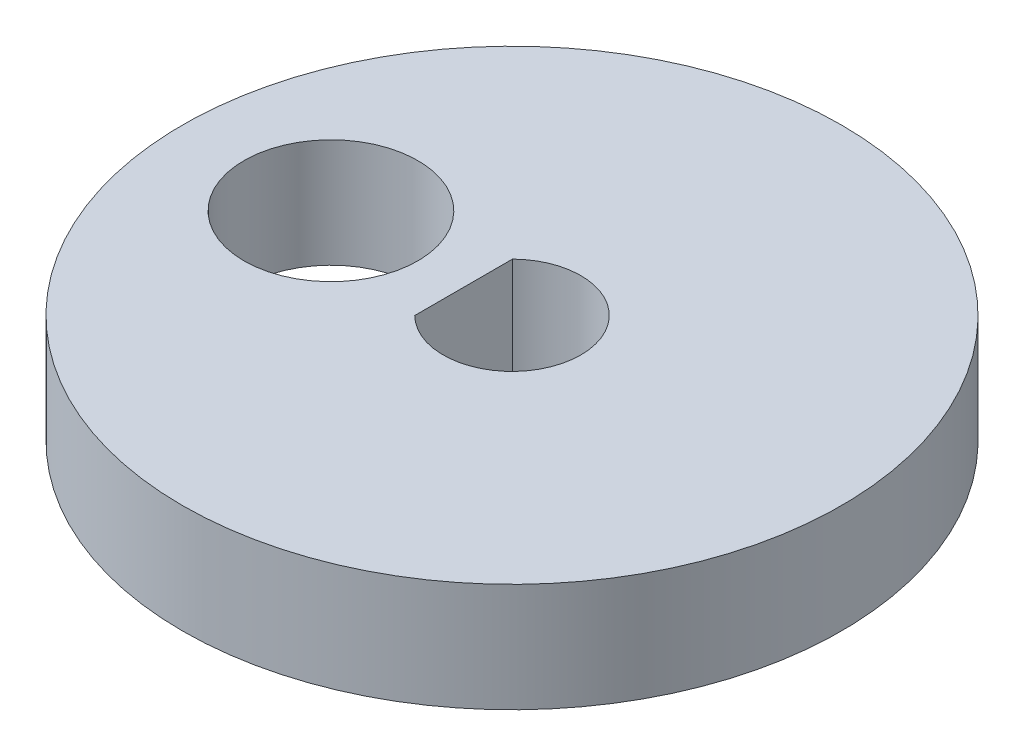
ISO-10303-21;
HEADER;
FILE_DESCRIPTION(('STEP AP214'),'2;1');
FILE_NAME('part.step','',(''),(''),'','','');
FILE_SCHEMA(('AUTOMOTIVE_DESIGN { 1 0 10303 214 1 1 1 1 }'));
ENDSEC;
DATA;
#1=APPLICATION_CONTEXT('core data for automotive mechanical design processes');
#2=APPLICATION_PROTOCOL_DEFINITION('international standard','automotive_design',2000,#1);
#3=PRODUCT_CONTEXT('',#1,'mechanical');
#4=PRODUCT('Part','Part','',(#3));
#5=PRODUCT_RELATED_PRODUCT_CATEGORY('part','',(#4));
#6=PRODUCT_DEFINITION_FORMATION('','',#4);
#7=PRODUCT_DEFINITION_CONTEXT('part definition',#1,'design');
#8=PRODUCT_DEFINITION('design','',#6,#7);
#9=PRODUCT_DEFINITION_SHAPE('','',#8);
#10=(LENGTH_UNIT() NAMED_UNIT(*) SI_UNIT(.MILLI.,.METRE.));
#11=(NAMED_UNIT(*) PLANE_ANGLE_UNIT() SI_UNIT($,.RADIAN.));
#12=(NAMED_UNIT(*) SI_UNIT($,.STERADIAN.) SOLID_ANGLE_UNIT());
#13=UNCERTAINTY_MEASURE_WITH_UNIT(LENGTH_MEASURE(1.E-05),#10,'distance_accuracy_value','');
#14=(GEOMETRIC_REPRESENTATION_CONTEXT(3) GLOBAL_UNCERTAINTY_ASSIGNED_CONTEXT((#13)) GLOBAL_UNIT_ASSIGNED_CONTEXT((#10,
#11,#12)) REPRESENTATION_CONTEXT('',''));
#15=CARTESIAN_POINT('',(0.,0.,0.));
#16=DIRECTION('',(0.,0.,1.));
#17=DIRECTION('',(1.,0.,0.));
#18=AXIS2_PLACEMENT_3D('',#15,#16,#17);
#19=CARTESIAN_POINT('',(0.,3.,0.));
#20=DIRECTION('',(0.,1.,0.));
#21=DIRECTION('',(0.,0.,1.));
#22=AXIS2_PLACEMENT_3D('',#19,#20,#21);
#23=PLANE('',#22);
#24=CARTESIAN_POINT('',(0.,3.,0.));
#25=DIRECTION('',(0.,1.,0.));
#26=DIRECTION('',(0.,0.,1.));
#27=AXIS2_PLACEMENT_3D('',#24,#25,#26);
#28=CIRCLE('',#27,9.1);
#29=CARTESIAN_POINT('',(0.,3.,9.1));
#30=VERTEX_POINT('',#29);
#31=EDGE_CURVE('E11',#30,#30,#28,.T.);
#32=ORIENTED_EDGE('',*,*,#31,.T.);
#33=EDGE_LOOP('',(#32));
#34=FACE_BOUND('',#33,.T.);
#35=CARTESIAN_POINT('',(-5.,3.,0.));
#36=DIRECTION('',(0.,1.,0.));
#37=DIRECTION('',(0.,0.,1.));
#38=AXIS2_PLACEMENT_3D('',#35,#36,#37);
#39=CIRCLE('',#38,2.4);
#40=CARTESIAN_POINT('',(-5.,3.,2.4));
#41=VERTEX_POINT('',#40);
#42=EDGE_CURVE('E88',#41,#41,#39,.T.);
#43=ORIENTED_EDGE('',*,*,#42,.F.);
#44=EDGE_LOOP('',(#43));
#45=FACE_BOUND('',#44,.T.);
#46=DIRECTION('',(0.,0.,1.));
#47=VECTOR('',#46,1.);
#48=CARTESIAN_POINT('',(-1.33697419571209,3.,-1.35));
#49=LINE('',#48,#47);
#50=CARTESIAN_POINT('',(-1.33697419571209,3.,-1.35));
#51=VERTEX_POINT('',#50);
#52=CARTESIAN_POINT('',(-1.33697419571209,3.,1.35));
#53=VERTEX_POINT('',#52);
#54=EDGE_CURVE('E84',#51,#53,#49,.T.);
#55=ORIENTED_EDGE('',*,*,#54,.F.);
#56=CARTESIAN_POINT('',(0.,3.,0.));
#57=DIRECTION('',(0.,1.,0.));
#58=DIRECTION('',(0.,0.,1.));
#59=AXIS2_PLACEMENT_3D('',#56,#57,#58);
#60=CIRCLE('',#59,1.9);
#61=EDGE_CURVE('E74',#53,#51,#60,.T.);
#62=ORIENTED_EDGE('',*,*,#61,.F.);
#63=EDGE_LOOP('',(#55,#62));
#64=FACE_BOUND('',#63,.T.);
#65=ADVANCED_FACE('F42',(#34,#45,#64),#23,.T.);
#66=CARTESIAN_POINT('',(0.,0.,0.));
#67=DIRECTION('',(0.,1.,0.));
#68=DIRECTION('',(0.,0.,1.));
#69=AXIS2_PLACEMENT_3D('',#66,#67,#68);
#70=PLANE('',#69);
#71=CARTESIAN_POINT('',(-5.,0.,0.));
#72=DIRECTION('',(0.,1.,0.));
#73=DIRECTION('',(0.,0.,1.));
#74=AXIS2_PLACEMENT_3D('',#71,#72,#73);
#75=CIRCLE('',#74,2.4);
#76=CARTESIAN_POINT('',(-5.,0.,2.4));
#77=VERTEX_POINT('',#76);
#78=EDGE_CURVE('E79',#77,#77,#75,.T.);
#79=ORIENTED_EDGE('',*,*,#78,.T.);
#80=EDGE_LOOP('',(#79));
#81=FACE_BOUND('',#80,.T.);
#82=CARTESIAN_POINT('',(0.,0.,0.));
#83=DIRECTION('',(0.,1.,0.));
#84=DIRECTION('',(0.,0.,1.));
#85=AXIS2_PLACEMENT_3D('',#82,#83,#84);
#86=CIRCLE('',#85,9.1);
#87=CARTESIAN_POINT('',(0.,0.,9.1));
#88=VERTEX_POINT('',#87);
#89=EDGE_CURVE('E46',#88,#88,#86,.T.);
#90=ORIENTED_EDGE('',*,*,#89,.F.);
#91=EDGE_LOOP('',(#90));
#92=FACE_BOUND('',#91,.T.);
#93=CARTESIAN_POINT('',(0.,0.,0.));
#94=DIRECTION('',(0.,1.,0.));
#95=DIRECTION('',(0.,0.,1.));
#96=AXIS2_PLACEMENT_3D('',#93,#94,#95);
#97=CIRCLE('',#96,1.9);
#98=CARTESIAN_POINT('',(-1.33697419571209,0.,1.35));
#99=VERTEX_POINT('',#98);
#100=CARTESIAN_POINT('',(-1.33697419571209,0.,-1.35));
#101=VERTEX_POINT('',#100);
#102=EDGE_CURVE('E64',#99,#101,#97,.T.);
#103=ORIENTED_EDGE('',*,*,#102,.T.);
#104=DIRECTION('',(0.,0.,1.));
#105=VECTOR('',#104,1.);
#106=CARTESIAN_POINT('',(-1.33697419571209,0.,-1.35));
#107=LINE('',#106,#105);
#108=EDGE_CURVE('E70',#101,#99,#107,.T.);
#109=ORIENTED_EDGE('',*,*,#108,.T.);
#110=EDGE_LOOP('',(#103,#109));
#111=FACE_BOUND('',#110,.T.);
#112=ADVANCED_FACE('F81',(#81,#92,#111),#70,.F.);
#113=CARTESIAN_POINT('',(0.,3.,0.));
#114=DIRECTION('',(0.,-1.,0.));
#115=DIRECTION('',(0.,0.,-1.));
#116=AXIS2_PLACEMENT_3D('',#113,#114,#115);
#117=CYLINDRICAL_SURFACE('',#116,9.1);
#118=ORIENTED_EDGE('',*,*,#31,.F.);
#119=EDGE_LOOP('',(#118));
#120=FACE_BOUND('',#119,.T.);
#121=ORIENTED_EDGE('',*,*,#89,.T.);
#122=EDGE_LOOP('',(#121));
#123=FACE_BOUND('',#122,.T.);
#124=ADVANCED_FACE('F44',(#120,#123),#117,.T.);
#125=CARTESIAN_POINT('',(-5.,3.,0.));
#126=DIRECTION('',(0.,-1.,0.));
#127=DIRECTION('',(0.,0.,-1.));
#128=AXIS2_PLACEMENT_3D('',#125,#126,#127);
#129=CYLINDRICAL_SURFACE('',#128,2.4);
#130=ORIENTED_EDGE('',*,*,#42,.T.);
#131=EDGE_LOOP('',(#130));
#132=FACE_BOUND('',#131,.T.);
#133=ORIENTED_EDGE('',*,*,#78,.F.);
#134=EDGE_LOOP('',(#133));
#135=FACE_BOUND('',#134,.T.);
#136=ADVANCED_FACE('F96',(#132,#135),#129,.F.);
#137=CARTESIAN_POINT('',(0.,3.,0.));
#138=DIRECTION('',(0.,-1.,0.));
#139=DIRECTION('',(0.,0.,-1.));
#140=AXIS2_PLACEMENT_3D('',#137,#138,#139);
#141=CYLINDRICAL_SURFACE('',#140,1.9);
#142=ORIENTED_EDGE('',*,*,#102,.F.);
#143=DIRECTION('',(0.,-1.,0.));
#144=VECTOR('',#143,1.);
#145=CARTESIAN_POINT('',(-1.33697419571209,3.,1.35));
#146=LINE('',#145,#144);
#147=EDGE_CURVE('E72',#53,#99,#146,.T.);
#148=ORIENTED_EDGE('',*,*,#147,.F.);
#149=ORIENTED_EDGE('',*,*,#61,.T.);
#150=DIRECTION('',(0.,-1.,0.));
#151=VECTOR('',#150,1.);
#152=CARTESIAN_POINT('',(-1.33697419571209,3.,-1.35));
#153=LINE('',#152,#151);
#154=EDGE_CURVE('E57',#51,#101,#153,.T.);
#155=ORIENTED_EDGE('',*,*,#154,.T.);
#156=EDGE_LOOP('',(#142,#148,#149,#155));
#157=FACE_BOUND('',#156,.T.);
#158=ADVANCED_FACE('F76',(#157),#141,.F.);
#159=CARTESIAN_POINT('',(-1.33697419571209,3.,-1.35));
#160=DIRECTION('',(1.,0.,0.));
#161=DIRECTION('',(0.,0.,-1.));
#162=AXIS2_PLACEMENT_3D('',#159,#160,#161);
#163=PLANE('',#162);
#164=ORIENTED_EDGE('',*,*,#108,.F.);
#165=ORIENTED_EDGE('',*,*,#154,.F.);
#166=ORIENTED_EDGE('',*,*,#54,.T.);
#167=ORIENTED_EDGE('',*,*,#147,.T.);
#168=EDGE_LOOP('',(#164,#165,#166,#167));
#169=FACE_BOUND('',#168,.T.);
#170=ADVANCED_FACE('F71',(#169),#163,.T.);
#171=CLOSED_SHELL('',(#65,#112,#124,#136,#158,#170));
#172=MANIFOLD_SOLID_BREP('B2',#171);
#173=ADVANCED_BREP_SHAPE_REPRESENTATION('',(#18,#172),#14);
#174=SHAPE_DEFINITION_REPRESENTATION(#9,#173);
ENDSEC;
END-ISO-10303-21;
